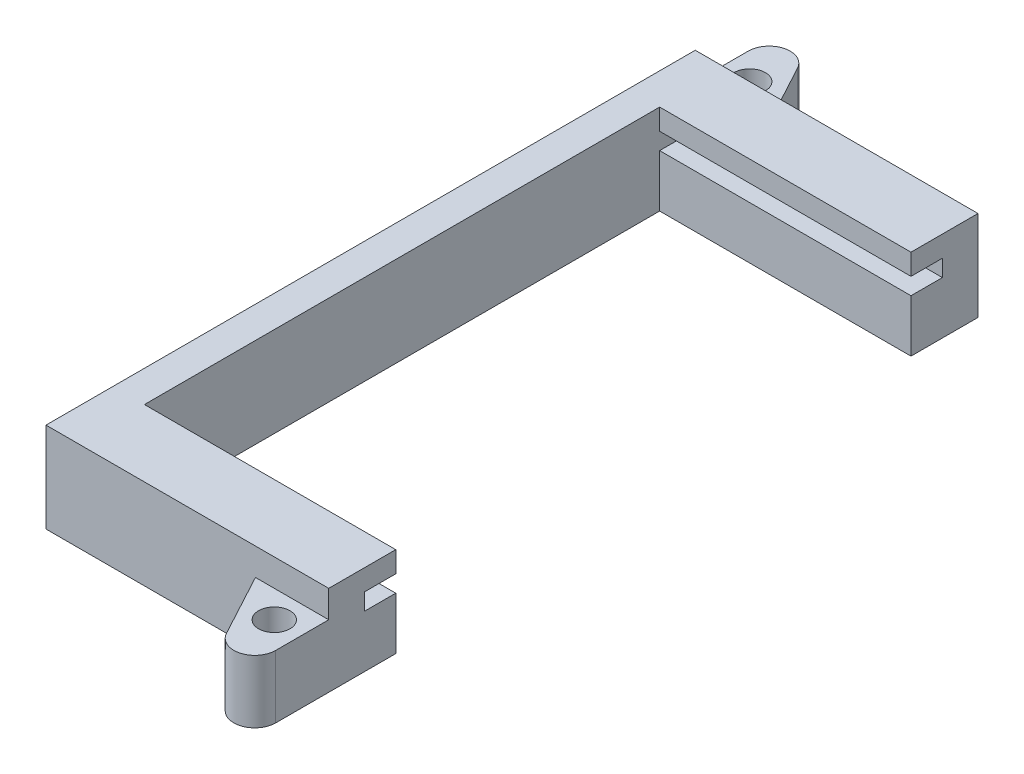
ISO-10303-21;
HEADER;
FILE_DESCRIPTION(('STEP AP214'),'2;1');
FILE_NAME('part.step','',(''),(''),'','','');
FILE_SCHEMA(('AUTOMOTIVE_DESIGN { 1 0 10303 214 1 1 1 1 }'));
ENDSEC;
DATA;
#1=APPLICATION_CONTEXT('core data for automotive mechanical design processes');
#2=APPLICATION_PROTOCOL_DEFINITION('international standard','automotive_design',2000,#1);
#3=PRODUCT_CONTEXT('',#1,'mechanical');
#4=PRODUCT('Part','Part','',(#3));
#5=PRODUCT_RELATED_PRODUCT_CATEGORY('part','',(#4));
#6=PRODUCT_DEFINITION_FORMATION('','',#4);
#7=PRODUCT_DEFINITION_CONTEXT('part definition',#1,'design');
#8=PRODUCT_DEFINITION('design','',#6,#7);
#9=PRODUCT_DEFINITION_SHAPE('','',#8);
#10=(LENGTH_UNIT() NAMED_UNIT(*) SI_UNIT(.MILLI.,.METRE.));
#11=(NAMED_UNIT(*) PLANE_ANGLE_UNIT() SI_UNIT($,.RADIAN.));
#12=(NAMED_UNIT(*) SI_UNIT($,.STERADIAN.) SOLID_ANGLE_UNIT());
#13=UNCERTAINTY_MEASURE_WITH_UNIT(LENGTH_MEASURE(1.E-05),#10,'distance_accuracy_value','');
#14=(GEOMETRIC_REPRESENTATION_CONTEXT(3) GLOBAL_UNCERTAINTY_ASSIGNED_CONTEXT((#13)) GLOBAL_UNIT_ASSIGNED_CONTEXT((#10,
#11,#12)) REPRESENTATION_CONTEXT('',''));
#15=CARTESIAN_POINT('',(0.,0.,0.));
#16=DIRECTION('',(0.,0.,1.));
#17=DIRECTION('',(1.,0.,0.));
#18=AXIS2_PLACEMENT_3D('',#15,#16,#17);
#19=CARTESIAN_POINT('',(30.48,6.35,-4.31800000000001));
#20=DIRECTION('',(0.,-1.,0.));
#21=DIRECTION('',(0.,0.,-1.));
#22=AXIS2_PLACEMENT_3D('',#19,#20,#21);
#23=PLANE('',#22);
#24=DIRECTION('',(0.,0.,1.));
#25=VECTOR('',#24,1.);
#26=CARTESIAN_POINT('',(0.,6.35,-4.31800000000001));
#27=LINE('',#26,#25);
#28=CARTESIAN_POINT('',(0.,6.35,-74.422));
#29=VERTEX_POINT('',#28);
#30=CARTESIAN_POINT('',(0.,6.35,-70.612));
#31=VERTEX_POINT('',#30);
#32=EDGE_CURVE('E331',#29,#31,#27,.T.);
#33=ORIENTED_EDGE('',*,*,#32,.T.);
#34=DIRECTION('',(-1.,0.,0.));
#35=VECTOR('',#34,1.);
#36=CARTESIAN_POINT('',(0.,6.35,-70.612));
#37=LINE('',#36,#35);
#38=CARTESIAN_POINT('',(30.48,6.35,-70.612));
#39=VERTEX_POINT('',#38);
#40=EDGE_CURVE('E53',#39,#31,#37,.T.);
#41=ORIENTED_EDGE('',*,*,#40,.F.);
#42=DIRECTION('',(0.,0.,1.));
#43=VECTOR('',#42,1.);
#44=CARTESIAN_POINT('',(30.48,6.35,-4.31800000000001));
#45=LINE('',#44,#43);
#46=CARTESIAN_POINT('',(30.48,6.35,-74.422));
#47=VERTEX_POINT('',#46);
#48=EDGE_CURVE('E311',#47,#39,#45,.T.);
#49=ORIENTED_EDGE('',*,*,#48,.F.);
#50=DIRECTION('',(-1.,0.,0.));
#51=VECTOR('',#50,1.);
#52=CARTESIAN_POINT('',(30.48,6.35,-74.422));
#53=LINE('',#52,#51);
#54=EDGE_CURVE('E355',#47,#29,#53,.T.);
#55=ORIENTED_EDGE('',*,*,#54,.T.);
#56=EDGE_LOOP('',(#33,#41,#49,#55));
#57=FACE_BOUND('',#56,.T.);
#58=ADVANCED_FACE('F38',(#57),#23,.F.);
#59=CARTESIAN_POINT('',(30.48,0.,0.));
#60=DIRECTION('',(-1.,0.,0.));
#61=DIRECTION('',(0.,0.,1.));
#62=AXIS2_PLACEMENT_3D('',#59,#60,#61);
#63=PLANE('',#62);
#64=ORIENTED_EDGE('',*,*,#48,.T.);
#65=DIRECTION('',(0.,1.,0.));
#66=VECTOR('',#65,1.);
#67=CARTESIAN_POINT('',(30.48,0.,-70.612));
#68=LINE('',#67,#66);
#69=CARTESIAN_POINT('',(30.48,0.,-70.612));
#70=VERTEX_POINT('',#69);
#71=EDGE_CURVE('E218',#70,#39,#68,.T.);
#72=ORIENTED_EDGE('',*,*,#71,.F.);
#73=DIRECTION('',(0.,0.,-1.));
#74=VECTOR('',#73,1.);
#75=CARTESIAN_POINT('',(30.48,0.,0.));
#76=LINE('',#75,#74);
#77=CARTESIAN_POINT('',(30.48,0.,-78.74));
#78=VERTEX_POINT('',#77);
#79=EDGE_CURVE('E296',#70,#78,#76,.T.);
#80=ORIENTED_EDGE('',*,*,#79,.T.);
#81=DIRECTION('',(0.,1.,0.));
#82=VECTOR('',#81,1.);
#83=CARTESIAN_POINT('',(30.48,0.,-78.74));
#84=LINE('',#83,#82);
#85=CARTESIAN_POINT('',(30.48,10.922,-78.74));
#86=VERTEX_POINT('',#85);
#87=EDGE_CURVE('E300',#78,#86,#84,.T.);
#88=ORIENTED_EDGE('',*,*,#87,.T.);
#89=DIRECTION('',(0.,0.,1.));
#90=VECTOR('',#89,1.);
#91=CARTESIAN_POINT('',(30.48,10.922,-78.74));
#92=LINE('',#91,#90);
#93=CARTESIAN_POINT('',(30.48,10.922,-70.612));
#94=VERTEX_POINT('',#93);
#95=EDGE_CURVE('E302',#86,#94,#92,.T.);
#96=ORIENTED_EDGE('',*,*,#95,.T.);
#97=DIRECTION('',(0.,-1.,0.));
#98=VECTOR('',#97,1.);
#99=CARTESIAN_POINT('',(30.48,10.922,-70.612));
#100=LINE('',#99,#98);
#101=CARTESIAN_POINT('',(30.48,8.382,-70.612));
#102=VERTEX_POINT('',#101);
#103=EDGE_CURVE('E304',#94,#102,#100,.T.);
#104=ORIENTED_EDGE('',*,*,#103,.T.);
#105=DIRECTION('',(0.,0.,-1.));
#106=VECTOR('',#105,1.);
#107=CARTESIAN_POINT('',(30.48,8.382,-70.612));
#108=LINE('',#107,#106);
#109=CARTESIAN_POINT('',(30.48,8.382,-74.422));
#110=VERTEX_POINT('',#109);
#111=EDGE_CURVE('E306',#102,#110,#108,.T.);
#112=ORIENTED_EDGE('',*,*,#111,.T.);
#113=DIRECTION('',(0.,-1.,0.));
#114=VECTOR('',#113,1.);
#115=CARTESIAN_POINT('',(30.48,8.382,-74.422));
#116=LINE('',#115,#114);
#117=EDGE_CURVE('E308',#110,#47,#116,.T.);
#118=ORIENTED_EDGE('',*,*,#117,.T.);
#119=EDGE_LOOP('',(#64,#72,#80,#88,#96,#104,#112,#118));
#120=FACE_BOUND('',#119,.T.);
#121=ADVANCED_FACE('F397',(#120),#63,.F.);
#122=CARTESIAN_POINT('',(30.48,0.,-78.74));
#123=DIRECTION('',(0.,0.,1.));
#124=DIRECTION('',(1.,0.,0.));
#125=AXIS2_PLACEMENT_3D('',#122,#123,#124);
#126=PLANE('',#125);
#127=DIRECTION('',(0.,-1.,0.));
#128=VECTOR('',#127,1.);
#129=CARTESIAN_POINT('',(5.08,7.62,-78.74));
#130=LINE('',#129,#128);
#131=CARTESIAN_POINT('',(5.08,7.62,-78.74));
#132=VERTEX_POINT('',#131);
#133=CARTESIAN_POINT('',(5.08,0.,-78.74));
#134=VERTEX_POINT('',#133);
#135=EDGE_CURVE('E224',#132,#134,#130,.T.);
#136=ORIENTED_EDGE('',*,*,#135,.F.);
#137=DIRECTION('',(-1.,0.,0.));
#138=VECTOR('',#137,1.);
#139=CARTESIAN_POINT('',(-3.81,7.62,-78.74));
#140=LINE('',#139,#138);
#141=CARTESIAN_POINT('',(-3.81,7.62,-78.74));
#142=VERTEX_POINT('',#141);
#143=EDGE_CURVE('E244',#132,#142,#140,.T.);
#144=ORIENTED_EDGE('',*,*,#143,.T.);
#145=DIRECTION('',(0.,1.,0.));
#146=VECTOR('',#145,1.);
#147=CARTESIAN_POINT('',(-3.81,0.,-78.74));
#148=LINE('',#147,#146);
#149=CARTESIAN_POINT('',(-3.81,10.922,-78.74));
#150=VERTEX_POINT('',#149);
#151=EDGE_CURVE('E280',#142,#150,#148,.T.);
#152=ORIENTED_EDGE('',*,*,#151,.T.);
#153=DIRECTION('',(-1.,0.,0.));
#154=VECTOR('',#153,1.);
#155=CARTESIAN_POINT('',(30.48,10.922,-78.74));
#156=LINE('',#155,#154);
#157=EDGE_CURVE('E367',#86,#150,#156,.T.);
#158=ORIENTED_EDGE('',*,*,#157,.F.);
#159=ORIENTED_EDGE('',*,*,#87,.F.);
#160=DIRECTION('',(-1.,0.,0.));
#161=VECTOR('',#160,1.);
#162=CARTESIAN_POINT('',(30.48,0.,-78.74));
#163=LINE('',#162,#161);
#164=EDGE_CURVE('E46',#78,#134,#163,.T.);
#165=ORIENTED_EDGE('',*,*,#164,.T.);
#166=EDGE_LOOP('',(#136,#144,#152,#158,#159,#165));
#167=FACE_BOUND('',#166,.T.);
#168=ADVANCED_FACE('F374',(#167),#126,.F.);
#169=CARTESIAN_POINT('',(30.48,0.,0.));
#170=DIRECTION('',(0.,0.,-1.));
#171=DIRECTION('',(-1.,0.,0.));
#172=AXIS2_PLACEMENT_3D('',#169,#170,#171);
#173=PLANE('',#172);
#174=DIRECTION('',(0.,-1.,0.));
#175=VECTOR('',#174,1.);
#176=CARTESIAN_POINT('',(21.59,7.62,0.));
#177=LINE('',#176,#175);
#178=CARTESIAN_POINT('',(21.59,7.62,0.));
#179=VERTEX_POINT('',#178);
#180=CARTESIAN_POINT('',(21.59,0.,0.));
#181=VERTEX_POINT('',#180);
#182=EDGE_CURVE('E273',#179,#181,#177,.T.);
#183=ORIENTED_EDGE('',*,*,#182,.F.);
#184=DIRECTION('',(1.,0.,0.));
#185=VECTOR('',#184,1.);
#186=CARTESIAN_POINT('',(21.59,7.62,0.));
#187=LINE('',#186,#185);
#188=CARTESIAN_POINT('',(30.48,7.62,0.));
#189=VERTEX_POINT('',#188);
#190=EDGE_CURVE('E255',#179,#189,#187,.T.);
#191=ORIENTED_EDGE('',*,*,#190,.T.);
#192=DIRECTION('',(0.,-1.,0.));
#193=VECTOR('',#192,1.);
#194=CARTESIAN_POINT('',(30.48,0.,0.));
#195=LINE('',#194,#193);
#196=CARTESIAN_POINT('',(30.48,10.922,0.));
#197=VERTEX_POINT('',#196);
#198=EDGE_CURVE('E293',#197,#189,#195,.T.);
#199=ORIENTED_EDGE('',*,*,#198,.F.);
#200=DIRECTION('',(-1.,0.,0.));
#201=VECTOR('',#200,1.);
#202=CARTESIAN_POINT('',(30.48,10.922,0.));
#203=LINE('',#202,#201);
#204=CARTESIAN_POINT('',(-3.81,10.922,0.));
#205=VERTEX_POINT('',#204);
#206=EDGE_CURVE('E322',#197,#205,#203,.T.);
#207=ORIENTED_EDGE('',*,*,#206,.T.);
#208=DIRECTION('',(0.,-1.,0.));
#209=VECTOR('',#208,1.);
#210=CARTESIAN_POINT('',(-3.81,0.,0.));
#211=LINE('',#210,#209);
#212=CARTESIAN_POINT('',(-3.81,0.,0.));
#213=VERTEX_POINT('',#212);
#214=EDGE_CURVE('E275',#205,#213,#211,.T.);
#215=ORIENTED_EDGE('',*,*,#214,.T.);
#216=DIRECTION('',(-1.,0.,0.));
#217=VECTOR('',#216,1.);
#218=CARTESIAN_POINT('',(30.48,0.,0.));
#219=LINE('',#218,#217);
#220=EDGE_CURVE('E11',#181,#213,#219,.T.);
#221=ORIENTED_EDGE('',*,*,#220,.F.);
#222=EDGE_LOOP('',(#183,#191,#199,#207,#215,#221));
#223=FACE_BOUND('',#222,.T.);
#224=ADVANCED_FACE('F40',(#223),#173,.F.);
#225=CARTESIAN_POINT('',(30.48,0.,0.));
#226=DIRECTION('',(0.,1.,0.));
#227=DIRECTION('',(0.,0.,1.));
#228=AXIS2_PLACEMENT_3D('',#225,#226,#227);
#229=PLANE('',#228);
#230=CARTESIAN_POINT('',(-0.508,0.,-82.042));
#231=DIRECTION('',(0.,1.,0.));
#232=DIRECTION('',(0.,0.,1.));
#233=AXIS2_PLACEMENT_3D('',#230,#231,#232);
#234=CIRCLE('',#233,1.90500000000001);
#235=CARTESIAN_POINT('',(-0.508,0.,-80.137));
#236=VERTEX_POINT('',#235);
#237=EDGE_CURVE('E221',#236,#236,#234,.T.);
#238=ORIENTED_EDGE('',*,*,#237,.T.);
#239=EDGE_LOOP('',(#238));
#240=FACE_BOUND('',#239,.T.);
#241=CARTESIAN_POINT('',(27.178,0.,3.302));
#242=DIRECTION('',(0.,1.,0.));
#243=DIRECTION('',(0.,0.,1.));
#244=AXIS2_PLACEMENT_3D('',#241,#242,#243);
#245=CIRCLE('',#244,1.905);
#246=CARTESIAN_POINT('',(27.178,0.,5.207));
#247=VERTEX_POINT('',#246);
#248=EDGE_CURVE('E217',#247,#247,#245,.T.);
#249=ORIENTED_EDGE('',*,*,#248,.T.);
#250=EDGE_LOOP('',(#249));
#251=FACE_BOUND('',#250,.T.);
#252=ORIENTED_EDGE('',*,*,#79,.F.);
#253=DIRECTION('',(-1.,0.,0.));
#254=VECTOR('',#253,1.);
#255=CARTESIAN_POINT('',(0.,0.,-70.612));
#256=LINE('',#255,#254);
#257=CARTESIAN_POINT('',(0.,0.,-70.612));
#258=VERTEX_POINT('',#257);
#259=EDGE_CURVE('E198',#70,#258,#256,.T.);
#260=ORIENTED_EDGE('',*,*,#259,.T.);
#261=DIRECTION('',(0.,0.,1.));
#262=VECTOR('',#261,1.);
#263=CARTESIAN_POINT('',(0.,0.,-70.612));
#264=LINE('',#263,#262);
#265=CARTESIAN_POINT('',(0.,0.,-8.12800000000001));
#266=VERTEX_POINT('',#265);
#267=EDGE_CURVE('E191',#258,#266,#264,.T.);
#268=ORIENTED_EDGE('',*,*,#267,.T.);
#269=DIRECTION('',(1.,0.,0.));
#270=VECTOR('',#269,1.);
#271=CARTESIAN_POINT('',(0.,0.,-8.12800000000001));
#272=LINE('',#271,#270);
#273=CARTESIAN_POINT('',(30.48,0.,-8.12800000000001));
#274=VERTEX_POINT('',#273);
#275=EDGE_CURVE('E201',#266,#274,#272,.T.);
#276=ORIENTED_EDGE('',*,*,#275,.T.);
#277=CARTESIAN_POINT('',(30.48,0.,6.42720814842723));
#278=VERTEX_POINT('',#277);
#279=EDGE_CURVE('E298',#278,#274,#76,.T.);
#280=ORIENTED_EDGE('',*,*,#279,.F.);
#281=CARTESIAN_POINT('',(27.94,0.,6.42720814842723));
#282=DIRECTION('',(0.,-1.,0.));
#283=DIRECTION('',(0.,0.,1.));
#284=AXIS2_PLACEMENT_3D('',#281,#282,#283);
#285=CIRCLE('',#284,2.54000000000001);
#286=CARTESIAN_POINT('',(25.7041388156116,0.,7.63241550160152));
#287=VERTEX_POINT('',#286);
#288=EDGE_CURVE('E247',#278,#287,#285,.T.);
#289=ORIENTED_EDGE('',*,*,#288,.T.);
#290=DIRECTION('',(-0.474491083926886,0.,-0.880260308814324));
#291=VECTOR('',#290,1.);
#292=CARTESIAN_POINT('',(21.59,0.,0.));
#293=LINE('',#292,#291);
#294=EDGE_CURVE('E259',#287,#181,#293,.T.);
#295=ORIENTED_EDGE('',*,*,#294,.T.);
#296=ORIENTED_EDGE('',*,*,#220,.T.);
#297=DIRECTION('',(0.,0.,1.));
#298=VECTOR('',#297,1.);
#299=CARTESIAN_POINT('',(-3.81,0.,-90.3074622973235));
#300=LINE('',#299,#298);
#301=CARTESIAN_POINT('',(-3.81,0.,-85.1672081484272));
#302=VERTEX_POINT('',#301);
#303=EDGE_CURVE('E283',#302,#213,#300,.T.);
#304=ORIENTED_EDGE('',*,*,#303,.F.);
#305=CARTESIAN_POINT('',(-1.27,0.,-85.1672081484272));
#306=DIRECTION('',(0.,-1.,0.));
#307=DIRECTION('',(0.,0.,-1.));
#308=AXIS2_PLACEMENT_3D('',#305,#306,#307);
#309=CIRCLE('',#308,2.54);
#310=CARTESIAN_POINT('',(0.965861184388385,0.,-86.3724155016015));
#311=VERTEX_POINT('',#310);
#312=EDGE_CURVE('E243',#302,#311,#309,.T.);
#313=ORIENTED_EDGE('',*,*,#312,.T.);
#314=DIRECTION('',(0.474491083926886,0.,0.880260308814324));
#315=VECTOR('',#314,1.);
#316=CARTESIAN_POINT('',(0.965861184388388,0.,-86.3724155016015));
#317=LINE('',#316,#315);
#318=EDGE_CURVE('E240',#311,#134,#317,.T.);
#319=ORIENTED_EDGE('',*,*,#318,.T.);
#320=ORIENTED_EDGE('',*,*,#164,.F.);
#321=EDGE_LOOP('',(#252,#260,#268,#276,#280,#289,#295,#296,#304,#313,#319,#320));
#322=FACE_BOUND('',#321,.T.);
#323=ADVANCED_FACE('F208',(#240,#251,#322),#229,.F.);
#324=CARTESIAN_POINT('',(30.48,10.922,-70.612));
#325=DIRECTION('',(0.,0.,-1.));
#326=DIRECTION('',(-1.,0.,0.));
#327=AXIS2_PLACEMENT_3D('',#324,#325,#326);
#328=PLANE('',#327);
#329=DIRECTION('',(0.,-1.,0.));
#330=VECTOR('',#329,1.);
#331=CARTESIAN_POINT('',(0.,10.922,-70.612));
#332=LINE('',#331,#330);
#333=CARTESIAN_POINT('',(0.,10.922,-70.612));
#334=VERTEX_POINT('',#333);
#335=CARTESIAN_POINT('',(0.,8.382,-70.612));
#336=VERTEX_POINT('',#335);
#337=EDGE_CURVE('E282',#334,#336,#332,.T.);
#338=ORIENTED_EDGE('',*,*,#337,.T.);
#339=DIRECTION('',(-1.,0.,0.));
#340=VECTOR('',#339,1.);
#341=CARTESIAN_POINT('',(30.48,8.382,-70.612));
#342=LINE('',#341,#340);
#343=EDGE_CURVE('E361',#102,#336,#342,.T.);
#344=ORIENTED_EDGE('',*,*,#343,.F.);
#345=ORIENTED_EDGE('',*,*,#103,.F.);
#346=DIRECTION('',(-1.,0.,0.));
#347=VECTOR('',#346,1.);
#348=CARTESIAN_POINT('',(30.48,10.922,-70.612));
#349=LINE('',#348,#347);
#350=EDGE_CURVE('E364',#94,#334,#349,.T.);
#351=ORIENTED_EDGE('',*,*,#350,.T.);
#352=EDGE_LOOP('',(#338,#344,#345,#351));
#353=FACE_BOUND('',#352,.T.);
#354=ADVANCED_FACE('F412',(#353),#328,.F.);
#355=CARTESIAN_POINT('',(30.48,8.382,-70.612));
#356=DIRECTION('',(0.,1.,0.));
#357=DIRECTION('',(0.,0.,1.));
#358=AXIS2_PLACEMENT_3D('',#355,#356,#357);
#359=PLANE('',#358);
#360=DIRECTION('',(0.,0.,-1.));
#361=VECTOR('',#360,1.);
#362=CARTESIAN_POINT('',(0.,8.382,-70.612));
#363=LINE('',#362,#361);
#364=CARTESIAN_POINT('',(0.,8.382,-74.422));
#365=VERTEX_POINT('',#364);
#366=EDGE_CURVE('E325',#336,#365,#363,.T.);
#367=ORIENTED_EDGE('',*,*,#366,.T.);
#368=DIRECTION('',(-1.,0.,0.));
#369=VECTOR('',#368,1.);
#370=CARTESIAN_POINT('',(30.48,8.382,-74.422));
#371=LINE('',#370,#369);
#372=EDGE_CURVE('E358',#110,#365,#371,.T.);
#373=ORIENTED_EDGE('',*,*,#372,.F.);
#374=ORIENTED_EDGE('',*,*,#111,.F.);
#375=ORIENTED_EDGE('',*,*,#343,.T.);
#376=EDGE_LOOP('',(#367,#373,#374,#375));
#377=FACE_BOUND('',#376,.T.);
#378=ADVANCED_FACE('F410',(#377),#359,.F.);
#379=CARTESIAN_POINT('',(30.48,8.382,-74.422));
#380=DIRECTION('',(0.,0.,-1.));
#381=DIRECTION('',(-1.,0.,0.));
#382=AXIS2_PLACEMENT_3D('',#379,#380,#381);
#383=PLANE('',#382);
#384=DIRECTION('',(0.,-1.,0.));
#385=VECTOR('',#384,1.);
#386=CARTESIAN_POINT('',(0.,8.382,-74.422));
#387=LINE('',#386,#385);
#388=EDGE_CURVE('E328',#365,#29,#387,.T.);
#389=ORIENTED_EDGE('',*,*,#388,.T.);
#390=ORIENTED_EDGE('',*,*,#54,.F.);
#391=ORIENTED_EDGE('',*,*,#117,.F.);
#392=ORIENTED_EDGE('',*,*,#372,.T.);
#393=EDGE_LOOP('',(#389,#390,#391,#392));
#394=FACE_BOUND('',#393,.T.);
#395=ADVANCED_FACE('F405',(#394),#383,.F.);
#396=CARTESIAN_POINT('',(30.48,6.35,-8.12800000000001));
#397=VERTEX_POINT('',#396);
#398=CARTESIAN_POINT('',(30.48,6.35,-4.31800000000001));
#399=VERTEX_POINT('',#398);
#400=EDGE_CURVE('E310',#397,#399,#45,.T.);
#401=ORIENTED_EDGE('',*,*,#400,.F.);
#402=DIRECTION('',(1.,0.,0.));
#403=VECTOR('',#402,1.);
#404=CARTESIAN_POINT('',(0.,6.35,-8.12800000000001));
#405=LINE('',#404,#403);
#406=CARTESIAN_POINT('',(0.,6.35,-8.12800000000001));
#407=VERTEX_POINT('',#406);
#408=EDGE_CURVE('E210',#407,#397,#405,.T.);
#409=ORIENTED_EDGE('',*,*,#408,.F.);
#410=CARTESIAN_POINT('',(0.,6.35,-4.31800000000001));
#411=VERTEX_POINT('',#410);
#412=EDGE_CURVE('E194',#407,#411,#27,.T.);
#413=ORIENTED_EDGE('',*,*,#412,.T.);
#414=DIRECTION('',(-1.,0.,0.));
#415=VECTOR('',#414,1.);
#416=CARTESIAN_POINT('',(30.48,6.35,-4.31800000000001));
#417=LINE('',#416,#415);
#418=EDGE_CURVE('E352',#399,#411,#417,.T.);
#419=ORIENTED_EDGE('',*,*,#418,.F.);
#420=EDGE_LOOP('',(#401,#409,#413,#419));
#421=FACE_BOUND('',#420,.T.);
#422=ADVANCED_FACE('F424',(#421),#23,.F.);
#423=CARTESIAN_POINT('',(30.48,8.382,-4.31800000000001));
#424=DIRECTION('',(0.,0.,1.));
#425=DIRECTION('',(1.,0.,0.));
#426=AXIS2_PLACEMENT_3D('',#423,#424,#425);
#427=PLANE('',#426);
#428=DIRECTION('',(0.,1.,0.));
#429=VECTOR('',#428,1.);
#430=CARTESIAN_POINT('',(0.,8.382,-4.31800000000001));
#431=LINE('',#430,#429);
#432=CARTESIAN_POINT('',(0.,8.382,-4.31800000000001));
#433=VERTEX_POINT('',#432);
#434=EDGE_CURVE('E334',#411,#433,#431,.T.);
#435=ORIENTED_EDGE('',*,*,#434,.T.);
#436=DIRECTION('',(-1.,0.,0.));
#437=VECTOR('',#436,1.);
#438=CARTESIAN_POINT('',(30.48,8.382,-4.31800000000001));
#439=LINE('',#438,#437);
#440=CARTESIAN_POINT('',(30.48,8.382,-4.31800000000001));
#441=VERTEX_POINT('',#440);
#442=EDGE_CURVE('E349',#441,#433,#439,.T.);
#443=ORIENTED_EDGE('',*,*,#442,.F.);
#444=DIRECTION('',(0.,1.,0.));
#445=VECTOR('',#444,1.);
#446=CARTESIAN_POINT('',(30.48,8.382,-4.31800000000001));
#447=LINE('',#446,#445);
#448=EDGE_CURVE('E314',#399,#441,#447,.T.);
#449=ORIENTED_EDGE('',*,*,#448,.F.);
#450=ORIENTED_EDGE('',*,*,#418,.T.);
#451=EDGE_LOOP('',(#435,#443,#449,#450));
#452=FACE_BOUND('',#451,.T.);
#453=ADVANCED_FACE('F433',(#452),#427,.F.);
#454=CARTESIAN_POINT('',(30.48,8.382,-8.12800000000001));
#455=DIRECTION('',(0.,1.,0.));
#456=DIRECTION('',(0.,0.,1.));
#457=AXIS2_PLACEMENT_3D('',#454,#455,#456);
#458=PLANE('',#457);
#459=DIRECTION('',(0.,0.,-1.));
#460=VECTOR('',#459,1.);
#461=CARTESIAN_POINT('',(0.,8.382,-8.12800000000001));
#462=LINE('',#461,#460);
#463=CARTESIAN_POINT('',(0.,8.382,-8.12800000000001));
#464=VERTEX_POINT('',#463);
#465=EDGE_CURVE('E337',#433,#464,#462,.T.);
#466=ORIENTED_EDGE('',*,*,#465,.T.);
#467=DIRECTION('',(-1.,0.,0.));
#468=VECTOR('',#467,1.);
#469=CARTESIAN_POINT('',(30.48,8.382,-8.12800000000001));
#470=LINE('',#469,#468);
#471=CARTESIAN_POINT('',(30.48,8.382,-8.12800000000001));
#472=VERTEX_POINT('',#471);
#473=EDGE_CURVE('E346',#472,#464,#470,.T.);
#474=ORIENTED_EDGE('',*,*,#473,.F.);
#475=DIRECTION('',(0.,0.,-1.));
#476=VECTOR('',#475,1.);
#477=CARTESIAN_POINT('',(30.48,8.382,-8.12800000000001));
#478=LINE('',#477,#476);
#479=EDGE_CURVE('E316',#441,#472,#478,.T.);
#480=ORIENTED_EDGE('',*,*,#479,.F.);
#481=ORIENTED_EDGE('',*,*,#442,.T.);
#482=EDGE_LOOP('',(#466,#474,#480,#481));
#483=FACE_BOUND('',#482,.T.);
#484=ADVANCED_FACE('F439',(#483),#458,.F.);
#485=CARTESIAN_POINT('',(30.48,10.922,-8.12800000000001));
#486=DIRECTION('',(0.,0.,1.));
#487=DIRECTION('',(0.,-1.,0.));
#488=AXIS2_PLACEMENT_3D('',#485,#486,#487);
#489=PLANE('',#488);
#490=DIRECTION('',(0.,1.,0.));
#491=VECTOR('',#490,1.);
#492=CARTESIAN_POINT('',(0.,10.922,-8.12800000000001));
#493=LINE('',#492,#491);
#494=CARTESIAN_POINT('',(0.,10.922,-8.12800000000001));
#495=VERTEX_POINT('',#494);
#496=EDGE_CURVE('E297',#464,#495,#493,.T.);
#497=ORIENTED_EDGE('',*,*,#496,.T.);
#498=DIRECTION('',(-1.,0.,0.));
#499=VECTOR('',#498,1.);
#500=CARTESIAN_POINT('',(30.48,10.922,-8.12800000000001));
#501=LINE('',#500,#499);
#502=CARTESIAN_POINT('',(30.48,10.922,-8.12800000000001));
#503=VERTEX_POINT('',#502);
#504=EDGE_CURVE('E343',#503,#495,#501,.T.);
#505=ORIENTED_EDGE('',*,*,#504,.F.);
#506=DIRECTION('',(0.,1.,0.));
#507=VECTOR('',#506,1.);
#508=CARTESIAN_POINT('',(30.48,10.922,-8.12800000000001));
#509=LINE('',#508,#507);
#510=EDGE_CURVE('E318',#472,#503,#509,.T.);
#511=ORIENTED_EDGE('',*,*,#510,.F.);
#512=ORIENTED_EDGE('',*,*,#473,.T.);
#513=EDGE_LOOP('',(#497,#505,#511,#512));
#514=FACE_BOUND('',#513,.T.);
#515=ADVANCED_FACE('F487',(#514),#489,.F.);
#516=CARTESIAN_POINT('',(30.48,10.922,0.));
#517=DIRECTION('',(0.,-1.,0.));
#518=DIRECTION('',(0.,0.,-1.));
#519=AXIS2_PLACEMENT_3D('',#516,#517,#518);
#520=PLANE('',#519);
#521=ORIENTED_EDGE('',*,*,#504,.T.);
#522=DIRECTION('',(0.,0.,1.));
#523=VECTOR('',#522,1.);
#524=CARTESIAN_POINT('',(0.,10.922,-90.3074622973235));
#525=LINE('',#524,#523);
#526=EDGE_CURVE('E286',#334,#495,#525,.T.);
#527=ORIENTED_EDGE('',*,*,#526,.F.);
#528=ORIENTED_EDGE('',*,*,#350,.F.);
#529=ORIENTED_EDGE('',*,*,#95,.F.);
#530=ORIENTED_EDGE('',*,*,#157,.T.);
#531=DIRECTION('',(0.,0.,1.));
#532=VECTOR('',#531,1.);
#533=CARTESIAN_POINT('',(-3.81,10.922,-90.3074622973235));
#534=LINE('',#533,#532);
#535=EDGE_CURVE('E289',#150,#205,#534,.T.);
#536=ORIENTED_EDGE('',*,*,#535,.T.);
#537=ORIENTED_EDGE('',*,*,#206,.F.);
#538=DIRECTION('',(0.,0.,1.));
#539=VECTOR('',#538,1.);
#540=CARTESIAN_POINT('',(30.48,10.922,0.));
#541=LINE('',#540,#539);
#542=EDGE_CURVE('E320',#503,#197,#541,.T.);
#543=ORIENTED_EDGE('',*,*,#542,.F.);
#544=EDGE_LOOP('',(#521,#527,#528,#529,#530,#536,#537,#543));
#545=FACE_BOUND('',#544,.T.);
#546=ADVANCED_FACE('F389',(#545),#520,.F.);
#547=ORIENTED_EDGE('',*,*,#279,.T.);
#548=DIRECTION('',(0.,1.,0.));
#549=VECTOR('',#548,1.);
#550=CARTESIAN_POINT('',(30.48,0.,-8.12800000000001));
#551=LINE('',#550,#549);
#552=EDGE_CURVE('E197',#274,#397,#551,.T.);
#553=ORIENTED_EDGE('',*,*,#552,.T.);
#554=ORIENTED_EDGE('',*,*,#400,.T.);
#555=ORIENTED_EDGE('',*,*,#448,.T.);
#556=ORIENTED_EDGE('',*,*,#479,.T.);
#557=ORIENTED_EDGE('',*,*,#510,.T.);
#558=ORIENTED_EDGE('',*,*,#542,.T.);
#559=ORIENTED_EDGE('',*,*,#198,.T.);
#560=DIRECTION('',(0.,0.,1.));
#561=VECTOR('',#560,1.);
#562=CARTESIAN_POINT('',(30.48,7.62,0.));
#563=LINE('',#562,#561);
#564=CARTESIAN_POINT('',(30.48,7.62,6.42720814842723));
#565=VERTEX_POINT('',#564);
#566=EDGE_CURVE('E258',#189,#565,#563,.T.);
#567=ORIENTED_EDGE('',*,*,#566,.T.);
#568=DIRECTION('',(0.,-1.,0.));
#569=VECTOR('',#568,1.);
#570=CARTESIAN_POINT('',(30.48,7.62,6.42720814842723));
#571=LINE('',#570,#569);
#572=EDGE_CURVE('E268',#565,#278,#571,.T.);
#573=ORIENTED_EDGE('',*,*,#572,.T.);
#574=EDGE_LOOP('',(#547,#553,#554,#555,#556,#557,#558,#559,#567,#573));
#575=FACE_BOUND('',#574,.T.);
#576=ADVANCED_FACE('F429',(#575),#63,.F.);
#577=CARTESIAN_POINT('',(0.,0.,-90.3074622973235));
#578=DIRECTION('',(1.,0.,0.));
#579=DIRECTION('',(0.,0.,-1.));
#580=AXIS2_PLACEMENT_3D('',#577,#578,#579);
#581=PLANE('',#580);
#582=ORIENTED_EDGE('',*,*,#496,.F.);
#583=ORIENTED_EDGE('',*,*,#465,.F.);
#584=ORIENTED_EDGE('',*,*,#434,.F.);
#585=ORIENTED_EDGE('',*,*,#412,.F.);
#586=DIRECTION('',(0.,1.,0.));
#587=VECTOR('',#586,1.);
#588=CARTESIAN_POINT('',(0.,0.,-8.12800000000001));
#589=LINE('',#588,#587);
#590=EDGE_CURVE('E187',#266,#407,#589,.T.);
#591=ORIENTED_EDGE('',*,*,#590,.F.);
#592=ORIENTED_EDGE('',*,*,#267,.F.);
#593=DIRECTION('',(0.,1.,0.));
#594=VECTOR('',#593,1.);
#595=CARTESIAN_POINT('',(0.,0.,-70.612));
#596=LINE('',#595,#594);
#597=EDGE_CURVE('E215',#258,#31,#596,.T.);
#598=ORIENTED_EDGE('',*,*,#597,.T.);
#599=ORIENTED_EDGE('',*,*,#32,.F.);
#600=ORIENTED_EDGE('',*,*,#388,.F.);
#601=ORIENTED_EDGE('',*,*,#366,.F.);
#602=ORIENTED_EDGE('',*,*,#337,.F.);
#603=ORIENTED_EDGE('',*,*,#526,.T.);
#604=EDGE_LOOP('',(#582,#583,#584,#585,#591,#592,#598,#599,#600,#601,#602,#603));
#605=FACE_BOUND('',#604,.T.);
#606=ADVANCED_FACE('F189',(#605),#581,.T.);
#607=CARTESIAN_POINT('',(-3.81,0.,-90.3074622973235));
#608=DIRECTION('',(-1.,0.,0.));
#609=DIRECTION('',(0.,0.,1.));
#610=AXIS2_PLACEMENT_3D('',#607,#608,#609);
#611=PLANE('',#610);
#612=ORIENTED_EDGE('',*,*,#151,.F.);
#613=DIRECTION('',(0.,0.,-1.));
#614=VECTOR('',#613,1.);
#615=CARTESIAN_POINT('',(-3.81,7.62,-78.74));
#616=LINE('',#615,#614);
#617=CARTESIAN_POINT('',(-3.81,7.62,-85.1672081484272));
#618=VERTEX_POINT('',#617);
#619=EDGE_CURVE('E61',#142,#618,#616,.T.);
#620=ORIENTED_EDGE('',*,*,#619,.T.);
#621=DIRECTION('',(0.,-1.,0.));
#622=VECTOR('',#621,1.);
#623=CARTESIAN_POINT('',(-3.81,7.62,-85.1672081484272));
#624=LINE('',#623,#622);
#625=EDGE_CURVE('E233',#618,#302,#624,.T.);
#626=ORIENTED_EDGE('',*,*,#625,.T.);
#627=ORIENTED_EDGE('',*,*,#303,.T.);
#628=ORIENTED_EDGE('',*,*,#214,.F.);
#629=ORIENTED_EDGE('',*,*,#535,.F.);
#630=EDGE_LOOP('',(#612,#620,#626,#627,#628,#629));
#631=FACE_BOUND('',#630,.T.);
#632=ADVANCED_FACE('F385',(#631),#611,.T.);
#633=CARTESIAN_POINT('',(21.59,7.62,0.));
#634=DIRECTION('',(-0.880260308814324,0.,0.474491083926886));
#635=DIRECTION('',(0.474491083926886,0.,0.880260308814324));
#636=AXIS2_PLACEMENT_3D('',#633,#634,#635);
#637=PLANE('',#636);
#638=ORIENTED_EDGE('',*,*,#294,.F.);
#639=DIRECTION('',(0.,-1.,0.));
#640=VECTOR('',#639,1.);
#641=CARTESIAN_POINT('',(25.7041388156116,7.62,7.63241550160152));
#642=LINE('',#641,#640);
#643=CARTESIAN_POINT('',(25.7041388156116,7.62,7.63241550160152));
#644=VERTEX_POINT('',#643);
#645=EDGE_CURVE('E276',#644,#287,#642,.T.);
#646=ORIENTED_EDGE('',*,*,#645,.F.);
#647=DIRECTION('',(-0.474491083926886,0.,-0.880260308814324));
#648=VECTOR('',#647,1.);
#649=CARTESIAN_POINT('',(21.59,7.62,0.));
#650=LINE('',#649,#648);
#651=EDGE_CURVE('E265',#644,#179,#650,.T.);
#652=ORIENTED_EDGE('',*,*,#651,.T.);
#653=ORIENTED_EDGE('',*,*,#182,.T.);
#654=EDGE_LOOP('',(#638,#646,#652,#653));
#655=FACE_BOUND('',#654,.T.);
#656=ADVANCED_FACE('F451',(#655),#637,.T.);
#657=CARTESIAN_POINT('',(27.94,7.62,6.42720814842723));
#658=DIRECTION('',(0.,-1.,0.));
#659=DIRECTION('',(0.,0.,-1.));
#660=AXIS2_PLACEMENT_3D('',#657,#658,#659);
#661=CYLINDRICAL_SURFACE('',#660,2.54000000000001);
#662=ORIENTED_EDGE('',*,*,#288,.F.);
#663=ORIENTED_EDGE('',*,*,#572,.F.);
#664=CARTESIAN_POINT('',(27.94,7.62,6.42720814842723));
#665=DIRECTION('',(0.,-1.,0.));
#666=DIRECTION('',(0.,0.,1.));
#667=AXIS2_PLACEMENT_3D('',#664,#665,#666);
#668=CIRCLE('',#667,2.54000000000001);
#669=EDGE_CURVE('E262',#565,#644,#668,.T.);
#670=ORIENTED_EDGE('',*,*,#669,.T.);
#671=ORIENTED_EDGE('',*,*,#645,.T.);
#672=EDGE_LOOP('',(#662,#663,#670,#671));
#673=FACE_BOUND('',#672,.T.);
#674=ADVANCED_FACE('F474',(#673),#661,.T.);
#675=CARTESIAN_POINT('',(27.94,7.62,6.42720814842723));
#676=DIRECTION('',(0.,1.,0.));
#677=DIRECTION('',(0.,0.,1.));
#678=AXIS2_PLACEMENT_3D('',#675,#676,#677);
#679=PLANE('',#678);
#680=CARTESIAN_POINT('',(27.178,7.62,3.302));
#681=DIRECTION('',(0.,1.,0.));
#682=DIRECTION('',(0.,0.,1.));
#683=AXIS2_PLACEMENT_3D('',#680,#681,#682);
#684=CIRCLE('',#683,1.905);
#685=CARTESIAN_POINT('',(27.178,7.62,5.207));
#686=VERTEX_POINT('',#685);
#687=EDGE_CURVE('E228',#686,#686,#684,.T.);
#688=ORIENTED_EDGE('',*,*,#687,.F.);
#689=EDGE_LOOP('',(#688));
#690=FACE_BOUND('',#689,.T.);
#691=ORIENTED_EDGE('',*,*,#190,.F.);
#692=ORIENTED_EDGE('',*,*,#651,.F.);
#693=ORIENTED_EDGE('',*,*,#669,.F.);
#694=ORIENTED_EDGE('',*,*,#566,.F.);
#695=EDGE_LOOP('',(#691,#692,#693,#694));
#696=FACE_BOUND('',#695,.T.);
#697=ADVANCED_FACE('F466',(#690,#696),#679,.T.);
#698=CARTESIAN_POINT('',(0.965861184388388,7.62,-86.3724155016015));
#699=DIRECTION('',(0.880260308814324,0.,-0.474491083926886));
#700=DIRECTION('',(-0.474491083926886,0.,-0.880260308814324));
#701=AXIS2_PLACEMENT_3D('',#698,#699,#700);
#702=PLANE('',#701);
#703=ORIENTED_EDGE('',*,*,#318,.F.);
#704=DIRECTION('',(0.,-1.,0.));
#705=VECTOR('',#704,1.);
#706=CARTESIAN_POINT('',(0.965861184388385,7.62,-86.3724155016015));
#707=LINE('',#706,#705);
#708=CARTESIAN_POINT('',(0.965861184388385,7.62,-86.3724155016015));
#709=VERTEX_POINT('',#708);
#710=EDGE_CURVE('E237',#709,#311,#707,.T.);
#711=ORIENTED_EDGE('',*,*,#710,.F.);
#712=DIRECTION('',(0.474491083926886,0.,0.880260308814324));
#713=VECTOR('',#712,1.);
#714=CARTESIAN_POINT('',(0.965861184388388,7.62,-86.3724155016015));
#715=LINE('',#714,#713);
#716=EDGE_CURVE('E236',#709,#132,#715,.T.);
#717=ORIENTED_EDGE('',*,*,#716,.T.);
#718=ORIENTED_EDGE('',*,*,#135,.T.);
#719=EDGE_LOOP('',(#703,#711,#717,#718));
#720=FACE_BOUND('',#719,.T.);
#721=ADVANCED_FACE('F379',(#720),#702,.T.);
#722=CARTESIAN_POINT('',(-1.27,7.62,-85.1672081484272));
#723=DIRECTION('',(0.,-1.,0.));
#724=DIRECTION('',(0.,0.,-1.));
#725=AXIS2_PLACEMENT_3D('',#722,#723,#724);
#726=CYLINDRICAL_SURFACE('',#725,2.54);
#727=ORIENTED_EDGE('',*,*,#312,.F.);
#728=ORIENTED_EDGE('',*,*,#625,.F.);
#729=CARTESIAN_POINT('',(-1.27,7.62,-85.1672081484272));
#730=DIRECTION('',(0.,-1.,0.));
#731=DIRECTION('',(0.,0.,-1.));
#732=AXIS2_PLACEMENT_3D('',#729,#730,#731);
#733=CIRCLE('',#732,2.54);
#734=EDGE_CURVE('E250',#618,#709,#733,.T.);
#735=ORIENTED_EDGE('',*,*,#734,.T.);
#736=ORIENTED_EDGE('',*,*,#710,.T.);
#737=EDGE_LOOP('',(#727,#728,#735,#736));
#738=FACE_BOUND('',#737,.T.);
#739=ADVANCED_FACE('F456',(#738),#726,.T.);
#740=CARTESIAN_POINT('',(-1.27,7.62,-85.1672081484272));
#741=DIRECTION('',(0.,-1.,0.));
#742=DIRECTION('',(0.,0.,-1.));
#743=AXIS2_PLACEMENT_3D('',#740,#741,#742);
#744=PLANE('',#743);
#745=CARTESIAN_POINT('',(-0.508,7.62,-82.042));
#746=DIRECTION('',(0.,1.,0.));
#747=DIRECTION('',(0.,0.,1.));
#748=AXIS2_PLACEMENT_3D('',#745,#746,#747);
#749=CIRCLE('',#748,1.90500000000001);
#750=CARTESIAN_POINT('',(-0.508,7.62,-80.137));
#751=VERTEX_POINT('',#750);
#752=EDGE_CURVE('E225',#751,#751,#749,.T.);
#753=ORIENTED_EDGE('',*,*,#752,.F.);
#754=EDGE_LOOP('',(#753));
#755=FACE_BOUND('',#754,.T.);
#756=ORIENTED_EDGE('',*,*,#143,.F.);
#757=ORIENTED_EDGE('',*,*,#716,.F.);
#758=ORIENTED_EDGE('',*,*,#734,.F.);
#759=ORIENTED_EDGE('',*,*,#619,.F.);
#760=EDGE_LOOP('',(#756,#757,#758,#759));
#761=FACE_BOUND('',#760,.T.);
#762=ADVANCED_FACE('F381',(#755,#761),#744,.F.);
#763=CARTESIAN_POINT('',(-0.508,0.,-82.042));
#764=DIRECTION('',(0.,1.,0.));
#765=DIRECTION('',(0.,0.,1.));
#766=AXIS2_PLACEMENT_3D('',#763,#764,#765);
#767=CYLINDRICAL_SURFACE('',#766,1.90500000000001);
#768=ORIENTED_EDGE('',*,*,#237,.F.);
#769=EDGE_LOOP('',(#768));
#770=FACE_BOUND('',#769,.T.);
#771=ORIENTED_EDGE('',*,*,#752,.T.);
#772=EDGE_LOOP('',(#771));
#773=FACE_BOUND('',#772,.T.);
#774=ADVANCED_FACE('F463',(#770,#773),#767,.F.);
#775=CARTESIAN_POINT('',(27.178,0.,3.302));
#776=DIRECTION('',(0.,1.,0.));
#777=DIRECTION('',(0.,0.,1.));
#778=AXIS2_PLACEMENT_3D('',#775,#776,#777);
#779=CYLINDRICAL_SURFACE('',#778,1.905);
#780=ORIENTED_EDGE('',*,*,#248,.F.);
#781=EDGE_LOOP('',(#780));
#782=FACE_BOUND('',#781,.T.);
#783=ORIENTED_EDGE('',*,*,#687,.T.);
#784=EDGE_LOOP('',(#783));
#785=FACE_BOUND('',#784,.T.);
#786=ADVANCED_FACE('F469',(#782,#785),#779,.F.);
#787=CARTESIAN_POINT('',(0.,0.,-70.612));
#788=DIRECTION('',(0.,0.,-1.));
#789=DIRECTION('',(-1.,0.,0.));
#790=AXIS2_PLACEMENT_3D('',#787,#788,#789);
#791=PLANE('',#790);
#792=ORIENTED_EDGE('',*,*,#40,.T.);
#793=ORIENTED_EDGE('',*,*,#597,.F.);
#794=ORIENTED_EDGE('',*,*,#259,.F.);
#795=ORIENTED_EDGE('',*,*,#71,.T.);
#796=EDGE_LOOP('',(#792,#793,#794,#795));
#797=FACE_BOUND('',#796,.T.);
#798=ADVANCED_FACE('F401',(#797),#791,.F.);
#799=CARTESIAN_POINT('',(0.,0.,-8.12800000000001));
#800=DIRECTION('',(0.,0.,1.));
#801=DIRECTION('',(1.,0.,0.));
#802=AXIS2_PLACEMENT_3D('',#799,#800,#801);
#803=PLANE('',#802);
#804=ORIENTED_EDGE('',*,*,#408,.T.);
#805=ORIENTED_EDGE('',*,*,#552,.F.);
#806=ORIENTED_EDGE('',*,*,#275,.F.);
#807=ORIENTED_EDGE('',*,*,#590,.T.);
#808=EDGE_LOOP('',(#804,#805,#806,#807));
#809=FACE_BOUND('',#808,.T.);
#810=ADVANCED_FACE('F202',(#809),#803,.F.);
#811=CLOSED_SHELL('',(#58,#121,#168,#224,#323,#354,#378,#395,#422,#453,#484,#515,#546,#576,#606,
#632,#656,#674,#697,#721,#739,#762,#774,#786,#798,#810));
#812=MANIFOLD_SOLID_BREP('B2',#811);
#813=ADVANCED_BREP_SHAPE_REPRESENTATION('',(#18,#812),#14);
#814=SHAPE_DEFINITION_REPRESENTATION(#9,#813);
ENDSEC;
END-ISO-10303-21;
